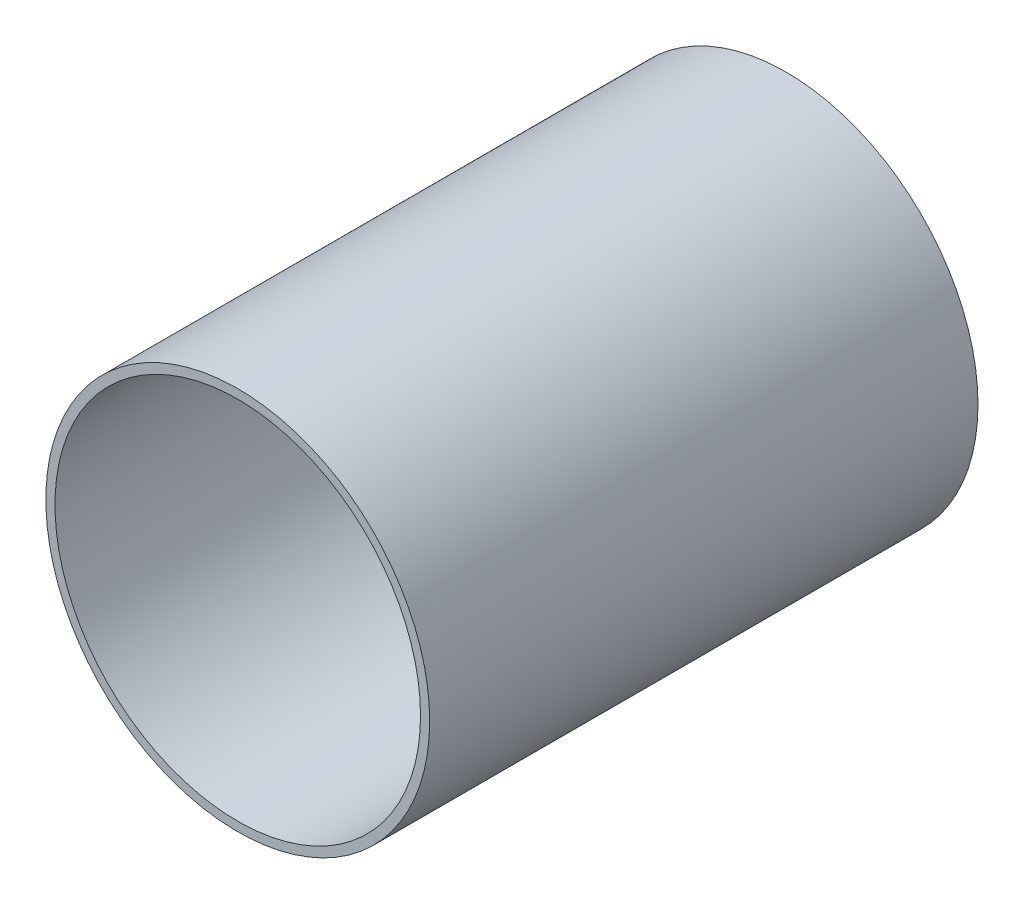
ISO-10303-21;
HEADER;
FILE_DESCRIPTION(('STEP AP214'),'2;1');
FILE_NAME('part.step','',(''),(''),'','','');
FILE_SCHEMA(('AUTOMOTIVE_DESIGN { 1 0 10303 214 1 1 1 1 }'));
ENDSEC;
DATA;
#1=APPLICATION_CONTEXT('core data for automotive mechanical design processes');
#2=APPLICATION_PROTOCOL_DEFINITION('international standard','automotive_design',2000,#1);
#3=PRODUCT_CONTEXT('',#1,'mechanical');
#4=PRODUCT('Part','Part','',(#3));
#5=PRODUCT_RELATED_PRODUCT_CATEGORY('part','',(#4));
#6=PRODUCT_DEFINITION_FORMATION('','',#4);
#7=PRODUCT_DEFINITION_CONTEXT('part definition',#1,'design');
#8=PRODUCT_DEFINITION('design','',#6,#7);
#9=PRODUCT_DEFINITION_SHAPE('','',#8);
#10=(LENGTH_UNIT() NAMED_UNIT(*) SI_UNIT(.MILLI.,.METRE.));
#11=(NAMED_UNIT(*) PLANE_ANGLE_UNIT() SI_UNIT($,.RADIAN.));
#12=(NAMED_UNIT(*) SI_UNIT($,.STERADIAN.) SOLID_ANGLE_UNIT());
#13=UNCERTAINTY_MEASURE_WITH_UNIT(LENGTH_MEASURE(1.E-05),#10,'distance_accuracy_value','');
#14=(GEOMETRIC_REPRESENTATION_CONTEXT(3) GLOBAL_UNCERTAINTY_ASSIGNED_CONTEXT((#13)) GLOBAL_UNIT_ASSIGNED_CONTEXT((#10,
#11,#12)) REPRESENTATION_CONTEXT('',''));
#15=CARTESIAN_POINT('',(0.,0.,0.));
#16=DIRECTION('',(0.,0.,1.));
#17=DIRECTION('',(1.,0.,0.));
#18=AXIS2_PLACEMENT_3D('',#15,#16,#17);
#19=CARTESIAN_POINT('',(0.,0.,152.4));
#20=DIRECTION('',(0.,0.,1.));
#21=DIRECTION('',(1.,0.,0.));
#22=AXIS2_PLACEMENT_3D('',#19,#20,#21);
#23=PLANE('',#22);
#24=CARTESIAN_POINT('',(0.,0.,152.4));
#25=DIRECTION('',(0.,0.,1.));
#26=DIRECTION('',(1.,0.,0.));
#27=AXIS2_PLACEMENT_3D('',#24,#25,#26);
#28=CIRCLE('',#27,53.34);
#29=CARTESIAN_POINT('',(53.34,0.,152.4));
#30=VERTEX_POINT('',#29);
#31=EDGE_CURVE('E10',#30,#30,#28,.T.);
#32=ORIENTED_EDGE('',*,*,#31,.T.);
#33=EDGE_LOOP('',(#32));
#34=FACE_BOUND('',#33,.T.);
#35=CARTESIAN_POINT('',(0.,0.,152.4));
#36=DIRECTION('',(0.,0.,1.));
#37=DIRECTION('',(1.,0.,0.));
#38=AXIS2_PLACEMENT_3D('',#35,#36,#37);
#39=CIRCLE('',#38,50.8);
#40=CARTESIAN_POINT('',(50.8,0.,152.4));
#41=VERTEX_POINT('',#40);
#42=EDGE_CURVE('E42',#41,#41,#39,.T.);
#43=ORIENTED_EDGE('',*,*,#42,.F.);
#44=EDGE_LOOP('',(#43));
#45=FACE_BOUND('',#44,.T.);
#46=ADVANCED_FACE('F31',(#34,#45),#23,.T.);
#47=CARTESIAN_POINT('',(0.,0.,0.));
#48=DIRECTION('',(0.,0.,1.));
#49=DIRECTION('',(1.,0.,0.));
#50=AXIS2_PLACEMENT_3D('',#47,#48,#49);
#51=PLANE('',#50);
#52=CARTESIAN_POINT('',(0.,0.,0.));
#53=DIRECTION('',(0.,0.,1.));
#54=DIRECTION('',(1.,0.,0.));
#55=AXIS2_PLACEMENT_3D('',#52,#53,#54);
#56=CIRCLE('',#55,53.34);
#57=CARTESIAN_POINT('',(53.34,0.,0.));
#58=VERTEX_POINT('',#57);
#59=EDGE_CURVE('E35',#58,#58,#56,.T.);
#60=ORIENTED_EDGE('',*,*,#59,.F.);
#61=EDGE_LOOP('',(#60));
#62=FACE_BOUND('',#61,.T.);
#63=CARTESIAN_POINT('',(0.,0.,0.));
#64=DIRECTION('',(0.,0.,1.));
#65=DIRECTION('',(1.,0.,0.));
#66=AXIS2_PLACEMENT_3D('',#63,#64,#65);
#67=CIRCLE('',#66,50.8);
#68=CARTESIAN_POINT('',(50.8,0.,0.));
#69=VERTEX_POINT('',#68);
#70=EDGE_CURVE('E44',#69,#69,#67,.T.);
#71=ORIENTED_EDGE('',*,*,#70,.T.);
#72=EDGE_LOOP('',(#71));
#73=FACE_BOUND('',#72,.T.);
#74=ADVANCED_FACE('F54',(#62,#73),#51,.F.);
#75=CARTESIAN_POINT('',(0.,0.,152.4));
#76=DIRECTION('',(0.,0.,-1.));
#77=DIRECTION('',(-1.,0.,0.));
#78=AXIS2_PLACEMENT_3D('',#75,#76,#77);
#79=CYLINDRICAL_SURFACE('',#78,53.34);
#80=ORIENTED_EDGE('',*,*,#31,.F.);
#81=EDGE_LOOP('',(#80));
#82=FACE_BOUND('',#81,.T.);
#83=ORIENTED_EDGE('',*,*,#59,.T.);
#84=EDGE_LOOP('',(#83));
#85=FACE_BOUND('',#84,.T.);
#86=ADVANCED_FACE('F33',(#82,#85),#79,.T.);
#87=CARTESIAN_POINT('',(0.,0.,152.4));
#88=DIRECTION('',(0.,0.,-1.));
#89=DIRECTION('',(-1.,0.,0.));
#90=AXIS2_PLACEMENT_3D('',#87,#88,#89);
#91=CYLINDRICAL_SURFACE('',#90,50.8);
#92=ORIENTED_EDGE('',*,*,#42,.T.);
#93=EDGE_LOOP('',(#92));
#94=FACE_BOUND('',#93,.T.);
#95=ORIENTED_EDGE('',*,*,#70,.F.);
#96=EDGE_LOOP('',(#95));
#97=FACE_BOUND('',#96,.T.);
#98=ADVANCED_FACE('F50',(#94,#97),#91,.F.);
#99=CLOSED_SHELL('',(#46,#74,#86,#98));
#100=MANIFOLD_SOLID_BREP('B2',#99);
#101=ADVANCED_BREP_SHAPE_REPRESENTATION('',(#18,#100),#14);
#102=SHAPE_DEFINITION_REPRESENTATION(#9,#101);
ENDSEC;
END-ISO-10303-21;
